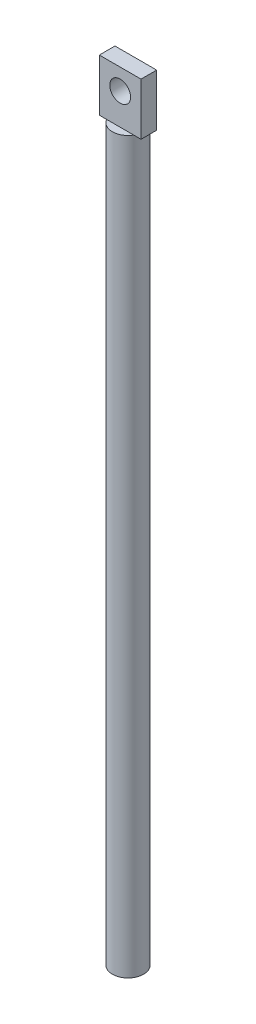
ISO-10303-21;
HEADER;
FILE_DESCRIPTION(('STEP AP214'),'2;1');
FILE_NAME('part.step','',(''),(''),'','','');
FILE_SCHEMA(('AUTOMOTIVE_DESIGN { 1 0 10303 214 1 1 1 1 }'));
ENDSEC;
DATA;
#1=APPLICATION_CONTEXT('core data for automotive mechanical design processes');
#2=APPLICATION_PROTOCOL_DEFINITION('international standard','automotive_design',2000,#1);
#3=PRODUCT_CONTEXT('',#1,'mechanical');
#4=PRODUCT('Part','Part','',(#3));
#5=PRODUCT_RELATED_PRODUCT_CATEGORY('part','',(#4));
#6=PRODUCT_DEFINITION_FORMATION('','',#4);
#7=PRODUCT_DEFINITION_CONTEXT('part definition',#1,'design');
#8=PRODUCT_DEFINITION('design','',#6,#7);
#9=PRODUCT_DEFINITION_SHAPE('','',#8);
#10=(LENGTH_UNIT() NAMED_UNIT(*) SI_UNIT(.MILLI.,.METRE.));
#11=(NAMED_UNIT(*) PLANE_ANGLE_UNIT() SI_UNIT($,.RADIAN.));
#12=(NAMED_UNIT(*) SI_UNIT($,.STERADIAN.) SOLID_ANGLE_UNIT());
#13=UNCERTAINTY_MEASURE_WITH_UNIT(LENGTH_MEASURE(1.E-05),#10,'distance_accuracy_value','');
#14=(GEOMETRIC_REPRESENTATION_CONTEXT(3) GLOBAL_UNCERTAINTY_ASSIGNED_CONTEXT((#13)) GLOBAL_UNIT_ASSIGNED_CONTEXT((#10,
#11,#12)) REPRESENTATION_CONTEXT('',''));
#15=CARTESIAN_POINT('',(0.,0.,0.));
#16=DIRECTION('',(0.,0.,1.));
#17=DIRECTION('',(1.,0.,0.));
#18=AXIS2_PLACEMENT_3D('',#15,#16,#17);
#19=CARTESIAN_POINT('',(0.,70.,0.));
#20=DIRECTION('',(0.,1.,0.));
#21=DIRECTION('',(0.,0.,1.));
#22=AXIS2_PLACEMENT_3D('',#19,#20,#21);
#23=PLANE('',#22);
#24=DIRECTION('',(1.,0.,0.));
#25=VECTOR('',#24,1.);
#26=CARTESIAN_POINT('',(-2.,70.,0.75));
#27=LINE('',#26,#25);
#28=CARTESIAN_POINT('',(-1.29903810567666,70.,0.75));
#29=VERTEX_POINT('',#28);
#30=CARTESIAN_POINT('',(1.29903810567666,70.,0.75));
#31=VERTEX_POINT('',#30);
#32=EDGE_CURVE('E11',#29,#31,#27,.T.);
#33=ORIENTED_EDGE('',*,*,#32,.F.);
#34=CARTESIAN_POINT('',(0.,70.,0.));
#35=DIRECTION('',(0.,1.,0.));
#36=DIRECTION('',(0.,0.,1.));
#37=AXIS2_PLACEMENT_3D('',#34,#35,#36);
#38=CIRCLE('',#37,1.5);
#39=EDGE_CURVE('E127',#29,#31,#38,.T.);
#40=ORIENTED_EDGE('',*,*,#39,.T.);
#41=EDGE_LOOP('',(#33,#40));
#42=FACE_BOUND('',#41,.T.);
#43=ADVANCED_FACE('F39',(#42),#23,.T.);
#44=CARTESIAN_POINT('',(0.,70.,0.));
#45=DIRECTION('',(0.,-1.,0.));
#46=DIRECTION('',(0.,0.,-1.));
#47=AXIS2_PLACEMENT_3D('',#44,#45,#46);
#48=CYLINDRICAL_SURFACE('',#47,1.5);
#49=CARTESIAN_POINT('',(1.29903810567666,70.,-0.75));
#50=VERTEX_POINT('',#49);
#51=EDGE_CURVE('E132',#31,#50,#38,.T.);
#52=ORIENTED_EDGE('',*,*,#51,.F.);
#53=ORIENTED_EDGE('',*,*,#39,.F.);
#54=CARTESIAN_POINT('',(-1.29903810567666,70.,-0.75));
#55=VERTEX_POINT('',#54);
#56=EDGE_CURVE('E144',#55,#29,#38,.T.);
#57=ORIENTED_EDGE('',*,*,#56,.F.);
#58=EDGE_CURVE('E135',#50,#55,#38,.T.);
#59=ORIENTED_EDGE('',*,*,#58,.F.);
#60=EDGE_LOOP('',(#52,#53,#57,#59));
#61=FACE_BOUND('',#60,.T.);
#62=CARTESIAN_POINT('',(0.,0.,0.));
#63=DIRECTION('',(0.,1.,0.));
#64=DIRECTION('',(0.,0.,1.));
#65=AXIS2_PLACEMENT_3D('',#62,#63,#64);
#66=CIRCLE('',#65,1.5);
#67=CARTESIAN_POINT('',(0.,0.,1.5));
#68=VERTEX_POINT('',#67);
#69=EDGE_CURVE('E122',#68,#68,#66,.T.);
#70=ORIENTED_EDGE('',*,*,#69,.T.);
#71=EDGE_LOOP('',(#70));
#72=FACE_BOUND('',#71,.T.);
#73=ADVANCED_FACE('F41',(#61,#72),#48,.T.);
#74=DIRECTION('',(-1.,0.,0.));
#75=VECTOR('',#74,1.);
#76=CARTESIAN_POINT('',(-2.,70.,-0.75));
#77=LINE('',#76,#75);
#78=EDGE_CURVE('E49',#50,#55,#77,.T.);
#79=ORIENTED_EDGE('',*,*,#78,.F.);
#80=ORIENTED_EDGE('',*,*,#58,.T.);
#81=EDGE_LOOP('',(#79,#80));
#82=FACE_BOUND('',#81,.T.);
#83=ADVANCED_FACE('F187',(#82),#23,.T.);
#84=CARTESIAN_POINT('',(0.,0.,0.));
#85=DIRECTION('',(0.,1.,0.));
#86=DIRECTION('',(0.,0.,1.));
#87=AXIS2_PLACEMENT_3D('',#84,#85,#86);
#88=PLANE('',#87);
#89=ORIENTED_EDGE('',*,*,#69,.F.);
#90=EDGE_LOOP('',(#89));
#91=FACE_BOUND('',#90,.T.);
#92=ADVANCED_FACE('F181',(#91),#88,.F.);
#93=CARTESIAN_POINT('',(0.,70.,0.));
#94=DIRECTION('',(0.,1.,0.));
#95=DIRECTION('',(0.,0.,1.));
#96=AXIS2_PLACEMENT_3D('',#93,#94,#95);
#97=PLANE('',#96);
#98=CARTESIAN_POINT('',(2.,70.,0.75));
#99=VERTEX_POINT('',#98);
#100=EDGE_CURVE('E52',#31,#99,#27,.T.);
#101=ORIENTED_EDGE('',*,*,#100,.F.);
#102=ORIENTED_EDGE('',*,*,#51,.T.);
#103=CARTESIAN_POINT('',(2.,70.,-0.75));
#104=VERTEX_POINT('',#103);
#105=EDGE_CURVE('E142',#104,#50,#77,.T.);
#106=ORIENTED_EDGE('',*,*,#105,.F.);
#107=DIRECTION('',(0.,0.,-1.));
#108=VECTOR('',#107,1.);
#109=CARTESIAN_POINT('',(2.,70.,-0.75));
#110=LINE('',#109,#108);
#111=EDGE_CURVE('E120',#99,#104,#110,.T.);
#112=ORIENTED_EDGE('',*,*,#111,.F.);
#113=EDGE_LOOP('',(#101,#102,#106,#112));
#114=FACE_BOUND('',#113,.T.);
#115=ADVANCED_FACE('F179',(#114),#97,.F.);
#116=CARTESIAN_POINT('',(-2.,70.,-0.75));
#117=VERTEX_POINT('',#116);
#118=EDGE_CURVE('E143',#55,#117,#77,.T.);
#119=ORIENTED_EDGE('',*,*,#118,.F.);
#120=ORIENTED_EDGE('',*,*,#56,.T.);
#121=CARTESIAN_POINT('',(-2.,70.,0.75));
#122=VERTEX_POINT('',#121);
#123=EDGE_CURVE('E51',#122,#29,#27,.T.);
#124=ORIENTED_EDGE('',*,*,#123,.F.);
#125=DIRECTION('',(0.,0.,1.));
#126=VECTOR('',#125,1.);
#127=CARTESIAN_POINT('',(-2.,70.,-0.75));
#128=LINE('',#127,#126);
#129=EDGE_CURVE('E162',#117,#122,#128,.T.);
#130=ORIENTED_EDGE('',*,*,#129,.F.);
#131=EDGE_LOOP('',(#119,#120,#124,#130));
#132=FACE_BOUND('',#131,.T.);
#133=ADVANCED_FACE('F153',(#132),#97,.F.);
#134=CARTESIAN_POINT('',(2.,75.,-0.75));
#135=DIRECTION('',(-1.,0.,0.));
#136=DIRECTION('',(0.,0.,1.));
#137=AXIS2_PLACEMENT_3D('',#134,#135,#136);
#138=PLANE('',#137);
#139=ORIENTED_EDGE('',*,*,#111,.T.);
#140=DIRECTION('',(0.,-1.,0.));
#141=VECTOR('',#140,1.);
#142=CARTESIAN_POINT('',(2.,75.,-0.75));
#143=LINE('',#142,#141);
#144=CARTESIAN_POINT('',(2.,75.,-0.75));
#145=VERTEX_POINT('',#144);
#146=EDGE_CURVE('E99',#145,#104,#143,.T.);
#147=ORIENTED_EDGE('',*,*,#146,.F.);
#148=DIRECTION('',(0.,0.,-1.));
#149=VECTOR('',#148,1.);
#150=CARTESIAN_POINT('',(2.,75.,-0.75));
#151=LINE('',#150,#149);
#152=CARTESIAN_POINT('',(2.,75.,0.75));
#153=VERTEX_POINT('',#152);
#154=EDGE_CURVE('E107',#153,#145,#151,.T.);
#155=ORIENTED_EDGE('',*,*,#154,.F.);
#156=DIRECTION('',(0.,-1.,0.));
#157=VECTOR('',#156,1.);
#158=CARTESIAN_POINT('',(2.,75.,0.75));
#159=LINE('',#158,#157);
#160=EDGE_CURVE('E165',#153,#99,#159,.T.);
#161=ORIENTED_EDGE('',*,*,#160,.T.);
#162=EDGE_LOOP('',(#139,#147,#155,#161));
#163=FACE_BOUND('',#162,.T.);
#164=ADVANCED_FACE('F118',(#163),#138,.F.);
#165=CARTESIAN_POINT('',(-2.,75.,-0.75));
#166=DIRECTION('',(0.,0.,1.));
#167=DIRECTION('',(1.,0.,0.));
#168=AXIS2_PLACEMENT_3D('',#165,#166,#167);
#169=PLANE('',#168);
#170=CARTESIAN_POINT('',(0.,73.,-0.75));
#171=DIRECTION('',(0.,0.,-1.));
#172=DIRECTION('',(-1.,0.,0.));
#173=AXIS2_PLACEMENT_3D('',#170,#171,#172);
#174=CIRCLE('',#173,1.);
#175=CARTESIAN_POINT('',(-1.,73.,-0.75));
#176=VERTEX_POINT('',#175);
#177=EDGE_CURVE('E282',#176,#176,#174,.T.);
#178=ORIENTED_EDGE('',*,*,#177,.F.);
#179=EDGE_LOOP('',(#178));
#180=FACE_BOUND('',#179,.T.);
#181=ORIENTED_EDGE('',*,*,#105,.T.);
#182=ORIENTED_EDGE('',*,*,#78,.T.);
#183=ORIENTED_EDGE('',*,*,#118,.T.);
#184=DIRECTION('',(0.,-1.,0.));
#185=VECTOR('',#184,1.);
#186=CARTESIAN_POINT('',(-2.,75.,-0.75));
#187=LINE('',#186,#185);
#188=CARTESIAN_POINT('',(-2.,75.,-0.75));
#189=VERTEX_POINT('',#188);
#190=EDGE_CURVE('E102',#189,#117,#187,.T.);
#191=ORIENTED_EDGE('',*,*,#190,.F.);
#192=DIRECTION('',(-1.,0.,0.));
#193=VECTOR('',#192,1.);
#194=CARTESIAN_POINT('',(-2.,75.,-0.75));
#195=LINE('',#194,#193);
#196=EDGE_CURVE('E94',#145,#189,#195,.T.);
#197=ORIENTED_EDGE('',*,*,#196,.F.);
#198=ORIENTED_EDGE('',*,*,#146,.T.);
#199=EDGE_LOOP('',(#181,#182,#183,#191,#197,#198));
#200=FACE_BOUND('',#199,.T.);
#201=ADVANCED_FACE('F97',(#180,#200),#169,.F.);
#202=CARTESIAN_POINT('',(-2.,75.,-0.75));
#203=DIRECTION('',(1.,0.,0.));
#204=DIRECTION('',(0.,0.,-1.));
#205=AXIS2_PLACEMENT_3D('',#202,#203,#204);
#206=PLANE('',#205);
#207=ORIENTED_EDGE('',*,*,#129,.T.);
#208=DIRECTION('',(0.,-1.,0.));
#209=VECTOR('',#208,1.);
#210=CARTESIAN_POINT('',(-2.,75.,0.75));
#211=LINE('',#210,#209);
#212=CARTESIAN_POINT('',(-2.,75.,0.75));
#213=VERTEX_POINT('',#212);
#214=EDGE_CURVE('E128',#213,#122,#211,.T.);
#215=ORIENTED_EDGE('',*,*,#214,.F.);
#216=DIRECTION('',(0.,0.,1.));
#217=VECTOR('',#216,1.);
#218=CARTESIAN_POINT('',(-2.,75.,-0.75));
#219=LINE('',#218,#217);
#220=EDGE_CURVE('E106',#189,#213,#219,.T.);
#221=ORIENTED_EDGE('',*,*,#220,.F.);
#222=ORIENTED_EDGE('',*,*,#190,.T.);
#223=EDGE_LOOP('',(#207,#215,#221,#222));
#224=FACE_BOUND('',#223,.T.);
#225=ADVANCED_FACE('F178',(#224),#206,.F.);
#226=CARTESIAN_POINT('',(-2.,75.,0.75));
#227=DIRECTION('',(0.,0.,-1.));
#228=DIRECTION('',(-1.,0.,0.));
#229=AXIS2_PLACEMENT_3D('',#226,#227,#228);
#230=PLANE('',#229);
#231=CARTESIAN_POINT('',(0.,73.,0.75));
#232=DIRECTION('',(0.,0.,-1.));
#233=DIRECTION('',(-1.,0.,0.));
#234=AXIS2_PLACEMENT_3D('',#231,#232,#233);
#235=CIRCLE('',#234,1.);
#236=CARTESIAN_POINT('',(-1.,73.,0.75));
#237=VERTEX_POINT('',#236);
#238=EDGE_CURVE('E43',#237,#237,#235,.T.);
#239=ORIENTED_EDGE('',*,*,#238,.T.);
#240=EDGE_LOOP('',(#239));
#241=FACE_BOUND('',#240,.T.);
#242=ORIENTED_EDGE('',*,*,#123,.T.);
#243=ORIENTED_EDGE('',*,*,#32,.T.);
#244=ORIENTED_EDGE('',*,*,#100,.T.);
#245=ORIENTED_EDGE('',*,*,#160,.F.);
#246=DIRECTION('',(1.,0.,0.));
#247=VECTOR('',#246,1.);
#248=CARTESIAN_POINT('',(-2.,75.,0.75));
#249=LINE('',#248,#247);
#250=EDGE_CURVE('E112',#213,#153,#249,.T.);
#251=ORIENTED_EDGE('',*,*,#250,.F.);
#252=ORIENTED_EDGE('',*,*,#214,.T.);
#253=EDGE_LOOP('',(#242,#243,#244,#245,#251,#252));
#254=FACE_BOUND('',#253,.T.);
#255=ADVANCED_FACE('F158',(#241,#254),#230,.F.);
#256=CARTESIAN_POINT('',(0.,75.,0.));
#257=DIRECTION('',(0.,1.,0.));
#258=DIRECTION('',(0.,0.,1.));
#259=AXIS2_PLACEMENT_3D('',#256,#257,#258);
#260=PLANE('',#259);
#261=ORIENTED_EDGE('',*,*,#154,.T.);
#262=ORIENTED_EDGE('',*,*,#196,.T.);
#263=ORIENTED_EDGE('',*,*,#220,.T.);
#264=ORIENTED_EDGE('',*,*,#250,.T.);
#265=EDGE_LOOP('',(#261,#262,#263,#264));
#266=FACE_BOUND('',#265,.T.);
#267=ADVANCED_FACE('F110',(#266),#260,.T.);
#268=CARTESIAN_POINT('',(0.,73.,1.5));
#269=DIRECTION('',(0.,0.,-1.));
#270=DIRECTION('',(-1.,0.,0.));
#271=AXIS2_PLACEMENT_3D('',#268,#269,#270);
#272=CYLINDRICAL_SURFACE('',#271,1.);
#273=ORIENTED_EDGE('',*,*,#177,.T.);
#274=EDGE_LOOP('',(#273));
#275=FACE_BOUND('',#274,.T.);
#276=ORIENTED_EDGE('',*,*,#238,.F.);
#277=EDGE_LOOP('',(#276));
#278=FACE_BOUND('',#277,.T.);
#279=ADVANCED_FACE('F264',(#275,#278),#272,.F.);
#280=CLOSED_SHELL('',(#43,#73,#83,#92,#115,#133,#164,#201,#225,#255,#267,#279));
#281=MANIFOLD_SOLID_BREP('B2',#280);
#282=ADVANCED_BREP_SHAPE_REPRESENTATION('',(#18,#281),#14);
#283=SHAPE_DEFINITION_REPRESENTATION(#9,#282);
ENDSEC;
END-ISO-10303-21;
